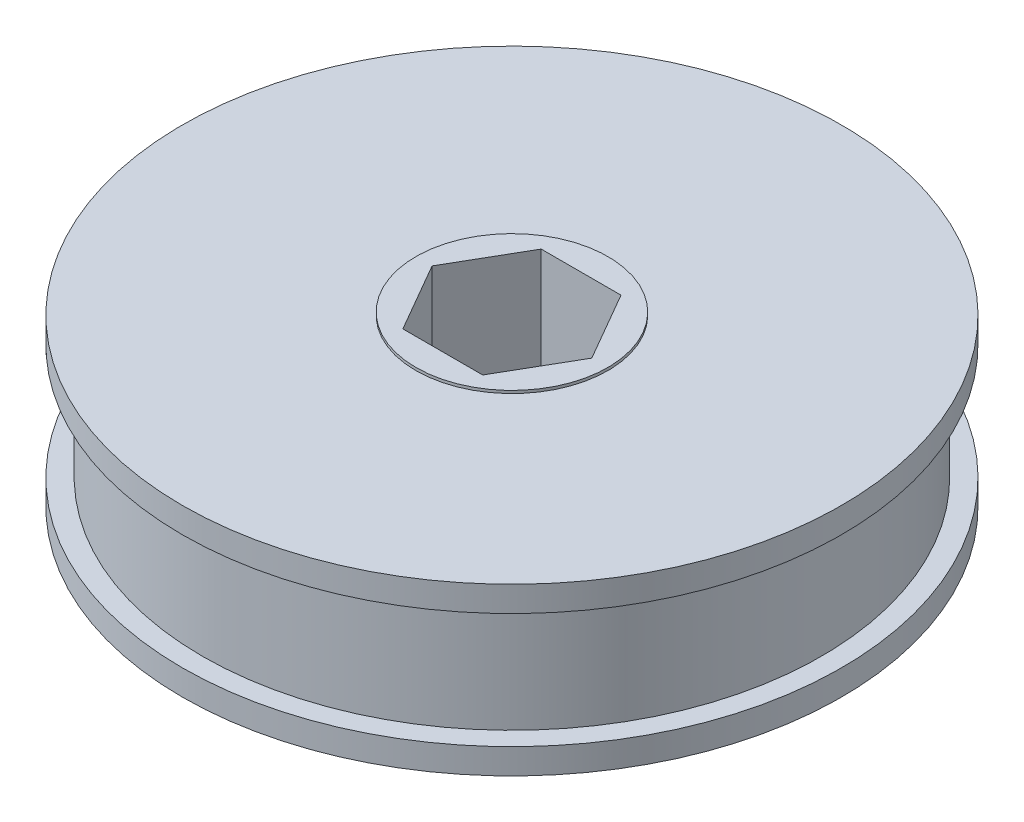
ISO-10303-21;
HEADER;
FILE_DESCRIPTION(('STEP AP214'),'2;1');
FILE_NAME('part.step','',(''),(''),'','','');
FILE_SCHEMA(('AUTOMOTIVE_DESIGN { 1 0 10303 214 1 1 1 1 }'));
ENDSEC;
DATA;
#1=APPLICATION_CONTEXT('core data for automotive mechanical design processes');
#2=APPLICATION_PROTOCOL_DEFINITION('international standard','automotive_design',2000,#1);
#3=PRODUCT_CONTEXT('',#1,'mechanical');
#4=PRODUCT('Part','Part','',(#3));
#5=PRODUCT_RELATED_PRODUCT_CATEGORY('part','',(#4));
#6=PRODUCT_DEFINITION_FORMATION('','',#4);
#7=PRODUCT_DEFINITION_CONTEXT('part definition',#1,'design');
#8=PRODUCT_DEFINITION('design','',#6,#7);
#9=PRODUCT_DEFINITION_SHAPE('','',#8);
#10=(LENGTH_UNIT() NAMED_UNIT(*) SI_UNIT(.MILLI.,.METRE.));
#11=(NAMED_UNIT(*) PLANE_ANGLE_UNIT() SI_UNIT($,.RADIAN.));
#12=(NAMED_UNIT(*) SI_UNIT($,.STERADIAN.) SOLID_ANGLE_UNIT());
#13=UNCERTAINTY_MEASURE_WITH_UNIT(LENGTH_MEASURE(1.E-05),#10,'distance_accuracy_value','');
#14=(GEOMETRIC_REPRESENTATION_CONTEXT(3) GLOBAL_UNCERTAINTY_ASSIGNED_CONTEXT((#13)) GLOBAL_UNIT_ASSIGNED_CONTEXT((#10,
#11,#12)) REPRESENTATION_CONTEXT('',''));
#15=CARTESIAN_POINT('',(0.,0.,0.));
#16=DIRECTION('',(0.,0.,1.));
#17=DIRECTION('',(1.,0.,0.));
#18=AXIS2_PLACEMENT_3D('',#15,#16,#17);
#19=CARTESIAN_POINT('',(0.,-3.2131,-2.53999999999999));
#20=DIRECTION('',(0.,-1.,0.));
#21=DIRECTION('',(0.,0.,-1.));
#22=AXIS2_PLACEMENT_3D('',#19,#20,#21);
#23=PLANE('',#22);
#24=DIRECTION('',(1.,0.,0.));
#25=VECTOR('',#24,1.);
#26=CARTESIAN_POINT('',(0.,-3.2131,-6.4008));
#27=LINE('',#26,#25);
#28=CARTESIAN_POINT('',(-3.69550360302896,-3.2131,-6.4008));
#29=VERTEX_POINT('',#28);
#30=CARTESIAN_POINT('',(3.69550360302896,-3.2131,-6.4008));
#31=VERTEX_POINT('',#30);
#32=EDGE_CURVE('E116',#29,#31,#27,.T.);
#33=ORIENTED_EDGE('',*,*,#32,.T.);
#34=DIRECTION('',(0.5,0.,0.866025403784439));
#35=VECTOR('',#34,1.);
#36=CARTESIAN_POINT('',(4.4434031417372,-3.2131,-5.1054));
#37=LINE('',#36,#35);
#38=CARTESIAN_POINT('',(7.39100720605792,-3.2131,0.));
#39=VERTEX_POINT('',#38);
#40=EDGE_CURVE('E91',#31,#39,#37,.T.);
#41=ORIENTED_EDGE('',*,*,#40,.T.);
#42=DIRECTION('',(-0.5,0.,0.866025403784439));
#43=VECTOR('',#42,1.);
#44=CARTESIAN_POINT('',(6.64310766734967,-3.2131,1.29540000000001));
#45=LINE('',#44,#43);
#46=CARTESIAN_POINT('',(3.69550360302896,-3.2131,6.4008));
#47=VERTEX_POINT('',#46);
#48=EDGE_CURVE('E137',#39,#47,#45,.T.);
#49=ORIENTED_EDGE('',*,*,#48,.T.);
#50=DIRECTION('',(-1.,0.,0.));
#51=VECTOR('',#50,1.);
#52=CARTESIAN_POINT('',(0.,-3.2131,6.4008));
#53=LINE('',#52,#51);
#54=CARTESIAN_POINT('',(-3.69550360302896,-3.2131,6.4008));
#55=VERTEX_POINT('',#54);
#56=EDGE_CURVE('E134',#47,#55,#53,.T.);
#57=ORIENTED_EDGE('',*,*,#56,.T.);
#58=DIRECTION('',(-0.5,0.,-0.866025403784439));
#59=VECTOR('',#58,1.);
#60=CARTESIAN_POINT('',(-6.64310766734967,-3.2131,1.29540000000001));
#61=LINE('',#60,#59);
#62=CARTESIAN_POINT('',(-7.39100720605791,-3.2131,0.));
#63=VERTEX_POINT('',#62);
#64=EDGE_CURVE('E131',#55,#63,#61,.T.);
#65=ORIENTED_EDGE('',*,*,#64,.T.);
#66=DIRECTION('',(0.5,0.,-0.866025403784439));
#67=VECTOR('',#66,1.);
#68=CARTESIAN_POINT('',(-4.4434031417372,-3.2131,-5.1054));
#69=LINE('',#68,#67);
#70=EDGE_CURVE('E128',#63,#29,#69,.T.);
#71=ORIENTED_EDGE('',*,*,#70,.T.);
#72=EDGE_LOOP('',(#33,#41,#49,#57,#65,#71));
#73=FACE_BOUND('',#72,.T.);
#74=CARTESIAN_POINT('',(0.,-3.2131,0.));
#75=DIRECTION('',(0.,1.,0.));
#76=DIRECTION('',(0.,0.,1.));
#77=AXIS2_PLACEMENT_3D('',#74,#75,#76);
#78=CIRCLE('',#77,8.89);
#79=CARTESIAN_POINT('',(0.,-3.2131,8.89));
#80=VERTEX_POINT('',#79);
#81=EDGE_CURVE('E11',#80,#80,#78,.T.);
#82=ORIENTED_EDGE('',*,*,#81,.T.);
#83=EDGE_LOOP('',(#82));
#84=FACE_BOUND('',#83,.T.);
#85=ADVANCED_FACE('F33',(#73,#84),#23,.F.);
#86=CARTESIAN_POINT('',(0.,55.,0.));
#87=DIRECTION('',(0.,1.,0.));
#88=DIRECTION('',(0.,0.,1.));
#89=AXIS2_PLACEMENT_3D('',#86,#87,#88);
#90=CYLINDRICAL_SURFACE('',#89,8.89);
#91=ORIENTED_EDGE('',*,*,#81,.F.);
#92=EDGE_LOOP('',(#91));
#93=FACE_BOUND('',#92,.T.);
#94=CARTESIAN_POINT('',(0.,-3.4671,0.));
#95=DIRECTION('',(0.,1.,0.));
#96=DIRECTION('',(0.,0.,1.));
#97=AXIS2_PLACEMENT_3D('',#94,#95,#96);
#98=CIRCLE('',#97,8.89);
#99=CARTESIAN_POINT('',(0.,-3.4671,8.89));
#100=VERTEX_POINT('',#99);
#101=EDGE_CURVE('E40',#100,#100,#98,.T.);
#102=ORIENTED_EDGE('',*,*,#101,.T.);
#103=EDGE_LOOP('',(#102));
#104=FACE_BOUND('',#103,.T.);
#105=ADVANCED_FACE('F167',(#93,#104),#90,.T.);
#106=CARTESIAN_POINT('',(0.,-3.4671,-8.89));
#107=DIRECTION('',(0.,-1.,0.));
#108=DIRECTION('',(0.,0.,-1.));
#109=AXIS2_PLACEMENT_3D('',#106,#107,#108);
#110=PLANE('',#109);
#111=ORIENTED_EDGE('',*,*,#101,.F.);
#112=EDGE_LOOP('',(#111));
#113=FACE_BOUND('',#112,.T.);
#114=CARTESIAN_POINT('',(0.,-3.4671,0.));
#115=DIRECTION('',(0.,1.,0.));
#116=DIRECTION('',(0.,0.,1.));
#117=AXIS2_PLACEMENT_3D('',#114,#115,#116);
#118=CIRCLE('',#117,30.5054);
#119=CARTESIAN_POINT('',(0.,-3.4671,30.5054));
#120=VERTEX_POINT('',#119);
#121=EDGE_CURVE('E162',#120,#120,#118,.T.);
#122=ORIENTED_EDGE('',*,*,#121,.T.);
#123=EDGE_LOOP('',(#122));
#124=FACE_BOUND('',#123,.T.);
#125=ADVANCED_FACE('F169',(#113,#124),#110,.F.);
#126=CARTESIAN_POINT('',(0.,55.,0.));
#127=DIRECTION('',(0.,1.,0.));
#128=DIRECTION('',(0.,0.,1.));
#129=AXIS2_PLACEMENT_3D('',#126,#127,#128);
#130=CYLINDRICAL_SURFACE('',#129,30.5054);
#131=ORIENTED_EDGE('',*,*,#121,.F.);
#132=EDGE_LOOP('',(#131));
#133=FACE_BOUND('',#132,.T.);
#134=CARTESIAN_POINT('',(0.,-5.8166,0.));
#135=DIRECTION('',(0.,1.,0.));
#136=DIRECTION('',(0.,0.,1.));
#137=AXIS2_PLACEMENT_3D('',#134,#135,#136);
#138=CIRCLE('',#137,30.5054);
#139=CARTESIAN_POINT('',(0.,-5.8166,30.5054));
#140=VERTEX_POINT('',#139);
#141=EDGE_CURVE('E159',#140,#140,#138,.T.);
#142=ORIENTED_EDGE('',*,*,#141,.T.);
#143=EDGE_LOOP('',(#142));
#144=FACE_BOUND('',#143,.T.);
#145=ADVANCED_FACE('F172',(#133,#144),#130,.T.);
#146=CARTESIAN_POINT('',(0.,-5.8166,-28.6512));
#147=DIRECTION('',(0.,1.,0.));
#148=DIRECTION('',(0.,0.,1.));
#149=AXIS2_PLACEMENT_3D('',#146,#147,#148);
#150=PLANE('',#149);
#151=ORIENTED_EDGE('',*,*,#141,.F.);
#152=EDGE_LOOP('',(#151));
#153=FACE_BOUND('',#152,.T.);
#154=CARTESIAN_POINT('',(0.,-5.8166,0.));
#155=DIRECTION('',(0.,1.,0.));
#156=DIRECTION('',(0.,0.,1.));
#157=AXIS2_PLACEMENT_3D('',#154,#155,#156);
#158=CIRCLE('',#157,28.6512);
#159=CARTESIAN_POINT('',(0.,-5.8166,28.6512));
#160=VERTEX_POINT('',#159);
#161=EDGE_CURVE('E156',#160,#160,#158,.T.);
#162=ORIENTED_EDGE('',*,*,#161,.T.);
#163=EDGE_LOOP('',(#162));
#164=FACE_BOUND('',#163,.T.);
#165=ADVANCED_FACE('F178',(#153,#164),#150,.F.);
#166=CARTESIAN_POINT('',(0.,55.,0.));
#167=DIRECTION('',(0.,1.,0.));
#168=DIRECTION('',(0.,0.,1.));
#169=AXIS2_PLACEMENT_3D('',#166,#167,#168);
#170=CYLINDRICAL_SURFACE('',#169,28.6512);
#171=ORIENTED_EDGE('',*,*,#161,.F.);
#172=EDGE_LOOP('',(#171));
#173=FACE_BOUND('',#172,.T.);
#174=CARTESIAN_POINT('',(0.,-16.4846,0.));
#175=DIRECTION('',(0.,1.,0.));
#176=DIRECTION('',(0.,0.,1.));
#177=AXIS2_PLACEMENT_3D('',#174,#175,#176);
#178=CIRCLE('',#177,28.6512);
#179=CARTESIAN_POINT('',(0.,-16.4846,28.6512));
#180=VERTEX_POINT('',#179);
#181=EDGE_CURVE('E153',#180,#180,#178,.T.);
#182=ORIENTED_EDGE('',*,*,#181,.T.);
#183=EDGE_LOOP('',(#182));
#184=FACE_BOUND('',#183,.T.);
#185=ADVANCED_FACE('F184',(#173,#184),#170,.T.);
#186=CARTESIAN_POINT('',(0.,-16.4846,-28.6512));
#187=DIRECTION('',(0.,-1.,0.));
#188=DIRECTION('',(0.,0.,-1.));
#189=AXIS2_PLACEMENT_3D('',#186,#187,#188);
#190=PLANE('',#189);
#191=ORIENTED_EDGE('',*,*,#181,.F.);
#192=EDGE_LOOP('',(#191));
#193=FACE_BOUND('',#192,.T.);
#194=CARTESIAN_POINT('',(0.,-16.4846,0.));
#195=DIRECTION('',(0.,1.,0.));
#196=DIRECTION('',(0.,0.,1.));
#197=AXIS2_PLACEMENT_3D('',#194,#195,#196);
#198=CIRCLE('',#197,30.5054);
#199=CARTESIAN_POINT('',(0.,-16.4846,30.5054));
#200=VERTEX_POINT('',#199);
#201=EDGE_CURVE('E150',#200,#200,#198,.T.);
#202=ORIENTED_EDGE('',*,*,#201,.T.);
#203=EDGE_LOOP('',(#202));
#204=FACE_BOUND('',#203,.T.);
#205=ADVANCED_FACE('F190',(#193,#204),#190,.F.);
#206=CARTESIAN_POINT('',(0.,55.,0.));
#207=DIRECTION('',(0.,1.,0.));
#208=DIRECTION('',(0.,0.,1.));
#209=AXIS2_PLACEMENT_3D('',#206,#207,#208);
#210=CYLINDRICAL_SURFACE('',#209,30.5054);
#211=ORIENTED_EDGE('',*,*,#201,.F.);
#212=EDGE_LOOP('',(#211));
#213=FACE_BOUND('',#212,.T.);
#214=CARTESIAN_POINT('',(0.,-18.8341,0.));
#215=DIRECTION('',(0.,1.,0.));
#216=DIRECTION('',(0.,0.,1.));
#217=AXIS2_PLACEMENT_3D('',#214,#215,#216);
#218=CIRCLE('',#217,30.5054);
#219=CARTESIAN_POINT('',(0.,-18.8341,30.5054));
#220=VERTEX_POINT('',#219);
#221=EDGE_CURVE('E147',#220,#220,#218,.T.);
#222=ORIENTED_EDGE('',*,*,#221,.T.);
#223=EDGE_LOOP('',(#222));
#224=FACE_BOUND('',#223,.T.);
#225=ADVANCED_FACE('F196',(#213,#224),#210,.T.);
#226=CARTESIAN_POINT('',(0.,-18.8341,-30.5054));
#227=DIRECTION('',(0.,1.,0.));
#228=DIRECTION('',(0.,0.,1.));
#229=AXIS2_PLACEMENT_3D('',#226,#227,#228);
#230=PLANE('',#229);
#231=ORIENTED_EDGE('',*,*,#221,.F.);
#232=EDGE_LOOP('',(#231));
#233=FACE_BOUND('',#232,.T.);
#234=CARTESIAN_POINT('',(0.,-18.8341,0.));
#235=DIRECTION('',(0.,1.,0.));
#236=DIRECTION('',(0.,0.,1.));
#237=AXIS2_PLACEMENT_3D('',#234,#235,#236);
#238=CIRCLE('',#237,8.89);
#239=CARTESIAN_POINT('',(0.,-18.8341,8.89));
#240=VERTEX_POINT('',#239);
#241=EDGE_CURVE('E144',#240,#240,#238,.T.);
#242=ORIENTED_EDGE('',*,*,#241,.T.);
#243=EDGE_LOOP('',(#242));
#244=FACE_BOUND('',#243,.T.);
#245=ADVANCED_FACE('F202',(#233,#244),#230,.F.);
#246=CARTESIAN_POINT('',(0.,55.,0.));
#247=DIRECTION('',(0.,1.,0.));
#248=DIRECTION('',(0.,0.,1.));
#249=AXIS2_PLACEMENT_3D('',#246,#247,#248);
#250=CYLINDRICAL_SURFACE('',#249,8.89);
#251=ORIENTED_EDGE('',*,*,#241,.F.);
#252=EDGE_LOOP('',(#251));
#253=FACE_BOUND('',#252,.T.);
#254=CARTESIAN_POINT('',(0.,-19.0881,0.));
#255=DIRECTION('',(0.,1.,0.));
#256=DIRECTION('',(0.,0.,1.));
#257=AXIS2_PLACEMENT_3D('',#254,#255,#256);
#258=CIRCLE('',#257,8.89);
#259=CARTESIAN_POINT('',(0.,-19.0881,8.89));
#260=VERTEX_POINT('',#259);
#261=EDGE_CURVE('E141',#260,#260,#258,.T.);
#262=ORIENTED_EDGE('',*,*,#261,.T.);
#263=EDGE_LOOP('',(#262));
#264=FACE_BOUND('',#263,.T.);
#265=ADVANCED_FACE('F208',(#253,#264),#250,.T.);
#266=CARTESIAN_POINT('',(0.,-19.0881,-8.89));
#267=DIRECTION('',(0.,1.,0.));
#268=DIRECTION('',(0.,0.,1.));
#269=AXIS2_PLACEMENT_3D('',#266,#267,#268);
#270=PLANE('',#269);
#271=DIRECTION('',(0.5,0.,-0.866025403784438));
#272=VECTOR('',#271,1.);
#273=CARTESIAN_POINT('',(3.69550360302896,-19.0881,6.4008));
#274=LINE('',#273,#272);
#275=CARTESIAN_POINT('',(3.69550360302896,-19.0881,6.4008));
#276=VERTEX_POINT('',#275);
#277=CARTESIAN_POINT('',(7.39100720605792,-19.0881,0.));
#278=VERTEX_POINT('',#277);
#279=EDGE_CURVE('E94',#276,#278,#274,.T.);
#280=ORIENTED_EDGE('',*,*,#279,.T.);
#281=DIRECTION('',(-0.5,0.,-0.866025403784438));
#282=VECTOR('',#281,1.);
#283=CARTESIAN_POINT('',(7.39100720605792,-19.0881,0.));
#284=LINE('',#283,#282);
#285=CARTESIAN_POINT('',(3.69550360302896,-19.0881,-6.4008));
#286=VERTEX_POINT('',#285);
#287=EDGE_CURVE('E88',#278,#286,#284,.T.);
#288=ORIENTED_EDGE('',*,*,#287,.T.);
#289=DIRECTION('',(-1.,0.,0.));
#290=VECTOR('',#289,1.);
#291=CARTESIAN_POINT('',(3.69550360302896,-19.0881,-6.4008));
#292=LINE('',#291,#290);
#293=CARTESIAN_POINT('',(-3.69550360302896,-19.0881,-6.4008));
#294=VERTEX_POINT('',#293);
#295=EDGE_CURVE('E97',#286,#294,#292,.T.);
#296=ORIENTED_EDGE('',*,*,#295,.T.);
#297=DIRECTION('',(-0.5,0.,0.866025403784439));
#298=VECTOR('',#297,1.);
#299=CARTESIAN_POINT('',(-3.69550360302896,-19.0881,-6.4008));
#300=LINE('',#299,#298);
#301=CARTESIAN_POINT('',(-7.39100720605791,-19.0881,0.));
#302=VERTEX_POINT('',#301);
#303=EDGE_CURVE('E55',#294,#302,#300,.T.);
#304=ORIENTED_EDGE('',*,*,#303,.T.);
#305=DIRECTION('',(0.5,0.,0.866025403784439));
#306=VECTOR('',#305,1.);
#307=CARTESIAN_POINT('',(-7.39100720605791,-19.0881,0.));
#308=LINE('',#307,#306);
#309=CARTESIAN_POINT('',(-3.69550360302896,-19.0881,6.4008));
#310=VERTEX_POINT('',#309);
#311=EDGE_CURVE('E108',#302,#310,#308,.T.);
#312=ORIENTED_EDGE('',*,*,#311,.T.);
#313=DIRECTION('',(1.,0.,0.));
#314=VECTOR('',#313,1.);
#315=CARTESIAN_POINT('',(-3.69550360302896,-19.0881,6.4008));
#316=LINE('',#315,#314);
#317=EDGE_CURVE('E111',#310,#276,#316,.T.);
#318=ORIENTED_EDGE('',*,*,#317,.T.);
#319=EDGE_LOOP('',(#280,#288,#296,#304,#312,#318));
#320=FACE_BOUND('',#319,.T.);
#321=ORIENTED_EDGE('',*,*,#261,.F.);
#322=EDGE_LOOP('',(#321));
#323=FACE_BOUND('',#322,.T.);
#324=ADVANCED_FACE('F101',(#320,#323),#270,.F.);
#325=CARTESIAN_POINT('',(7.39100720605792,-19.0881,0.));
#326=DIRECTION('',(0.866025403784438,0.,-0.5));
#327=DIRECTION('',(-0.5,0.,-0.866025403784439));
#328=AXIS2_PLACEMENT_3D('',#325,#326,#327);
#329=PLANE('',#328);
#330=DIRECTION('',(0.,1.,0.));
#331=VECTOR('',#330,1.);
#332=CARTESIAN_POINT('',(3.69550360302896,-19.0881,-6.4008));
#333=LINE('',#332,#331);
#334=EDGE_CURVE('E47',#286,#31,#333,.T.);
#335=ORIENTED_EDGE('',*,*,#334,.F.);
#336=ORIENTED_EDGE('',*,*,#287,.F.);
#337=DIRECTION('',(0.,1.,0.));
#338=VECTOR('',#337,1.);
#339=CARTESIAN_POINT('',(7.39100720605792,-19.0881,0.));
#340=LINE('',#339,#338);
#341=EDGE_CURVE('E114',#278,#39,#340,.T.);
#342=ORIENTED_EDGE('',*,*,#341,.T.);
#343=ORIENTED_EDGE('',*,*,#40,.F.);
#344=EDGE_LOOP('',(#335,#336,#342,#343));
#345=FACE_BOUND('',#344,.T.);
#346=ADVANCED_FACE('F85',(#345),#329,.F.);
#347=CARTESIAN_POINT('',(3.69550360302896,-19.0881,6.4008));
#348=DIRECTION('',(0.866025403784438,0.,0.5));
#349=DIRECTION('',(0.5,0.,-0.866025403784439));
#350=AXIS2_PLACEMENT_3D('',#347,#348,#349);
#351=PLANE('',#350);
#352=ORIENTED_EDGE('',*,*,#341,.F.);
#353=ORIENTED_EDGE('',*,*,#279,.F.);
#354=DIRECTION('',(0.,1.,0.));
#355=VECTOR('',#354,1.);
#356=CARTESIAN_POINT('',(3.69550360302896,-19.0881,6.4008));
#357=LINE('',#356,#355);
#358=EDGE_CURVE('E117',#276,#47,#357,.T.);
#359=ORIENTED_EDGE('',*,*,#358,.T.);
#360=ORIENTED_EDGE('',*,*,#48,.F.);
#361=EDGE_LOOP('',(#352,#353,#359,#360));
#362=FACE_BOUND('',#361,.T.);
#363=ADVANCED_FACE('F221',(#362),#351,.F.);
#364=CARTESIAN_POINT('',(-3.69550360302896,-19.0881,6.4008));
#365=DIRECTION('',(0.,0.,1.));
#366=DIRECTION('',(1.,0.,0.));
#367=AXIS2_PLACEMENT_3D('',#364,#365,#366);
#368=PLANE('',#367);
#369=ORIENTED_EDGE('',*,*,#358,.F.);
#370=ORIENTED_EDGE('',*,*,#317,.F.);
#371=DIRECTION('',(0.,1.,0.));
#372=VECTOR('',#371,1.);
#373=CARTESIAN_POINT('',(-3.69550360302896,-19.0881,6.4008));
#374=LINE('',#373,#372);
#375=EDGE_CURVE('E120',#310,#55,#374,.T.);
#376=ORIENTED_EDGE('',*,*,#375,.T.);
#377=ORIENTED_EDGE('',*,*,#56,.F.);
#378=EDGE_LOOP('',(#369,#370,#376,#377));
#379=FACE_BOUND('',#378,.T.);
#380=ADVANCED_FACE('F236',(#379),#368,.F.);
#381=CARTESIAN_POINT('',(-7.39100720605791,-19.0881,0.));
#382=DIRECTION('',(-0.866025403784439,0.,0.5));
#383=DIRECTION('',(0.5,0.,0.866025403784439));
#384=AXIS2_PLACEMENT_3D('',#381,#382,#383);
#385=PLANE('',#384);
#386=ORIENTED_EDGE('',*,*,#375,.F.);
#387=ORIENTED_EDGE('',*,*,#311,.F.);
#388=DIRECTION('',(0.,1.,0.));
#389=VECTOR('',#388,1.);
#390=CARTESIAN_POINT('',(-7.39100720605791,-19.0881,0.));
#391=LINE('',#390,#389);
#392=EDGE_CURVE('E123',#302,#63,#391,.T.);
#393=ORIENTED_EDGE('',*,*,#392,.T.);
#394=ORIENTED_EDGE('',*,*,#64,.F.);
#395=EDGE_LOOP('',(#386,#387,#393,#394));
#396=FACE_BOUND('',#395,.T.);
#397=ADVANCED_FACE('F234',(#396),#385,.F.);
#398=CARTESIAN_POINT('',(-3.69550360302896,-19.0881,-6.4008));
#399=DIRECTION('',(-0.866025403784439,0.,-0.5));
#400=DIRECTION('',(-0.5,0.,0.866025403784439));
#401=AXIS2_PLACEMENT_3D('',#398,#399,#400);
#402=PLANE('',#401);
#403=ORIENTED_EDGE('',*,*,#392,.F.);
#404=ORIENTED_EDGE('',*,*,#303,.F.);
#405=DIRECTION('',(0.,1.,0.));
#406=VECTOR('',#405,1.);
#407=CARTESIAN_POINT('',(-3.69550360302896,-19.0881,-6.4008));
#408=LINE('',#407,#406);
#409=EDGE_CURVE('E93',#294,#29,#408,.T.);
#410=ORIENTED_EDGE('',*,*,#409,.T.);
#411=ORIENTED_EDGE('',*,*,#70,.F.);
#412=EDGE_LOOP('',(#403,#404,#410,#411));
#413=FACE_BOUND('',#412,.T.);
#414=ADVANCED_FACE('F231',(#413),#402,.F.);
#415=CARTESIAN_POINT('',(3.69550360302896,-19.0881,-6.4008));
#416=DIRECTION('',(0.,0.,-1.));
#417=DIRECTION('',(-1.,0.,0.));
#418=AXIS2_PLACEMENT_3D('',#415,#416,#417);
#419=PLANE('',#418);
#420=ORIENTED_EDGE('',*,*,#409,.F.);
#421=ORIENTED_EDGE('',*,*,#295,.F.);
#422=ORIENTED_EDGE('',*,*,#334,.T.);
#423=ORIENTED_EDGE('',*,*,#32,.F.);
#424=EDGE_LOOP('',(#420,#421,#422,#423));
#425=FACE_BOUND('',#424,.T.);
#426=ADVANCED_FACE('F98',(#425),#419,.F.);
#427=CLOSED_SHELL('',(#85,#105,#125,#145,#165,#185,#205,#225,#245,#265,#324,#346,#363,#380,#397,
#414,#426));
#428=MANIFOLD_SOLID_BREP('B2',#427);
#429=ADVANCED_BREP_SHAPE_REPRESENTATION('',(#18,#428),#14);
#430=SHAPE_DEFINITION_REPRESENTATION(#9,#429);
ENDSEC;
END-ISO-10303-21;
